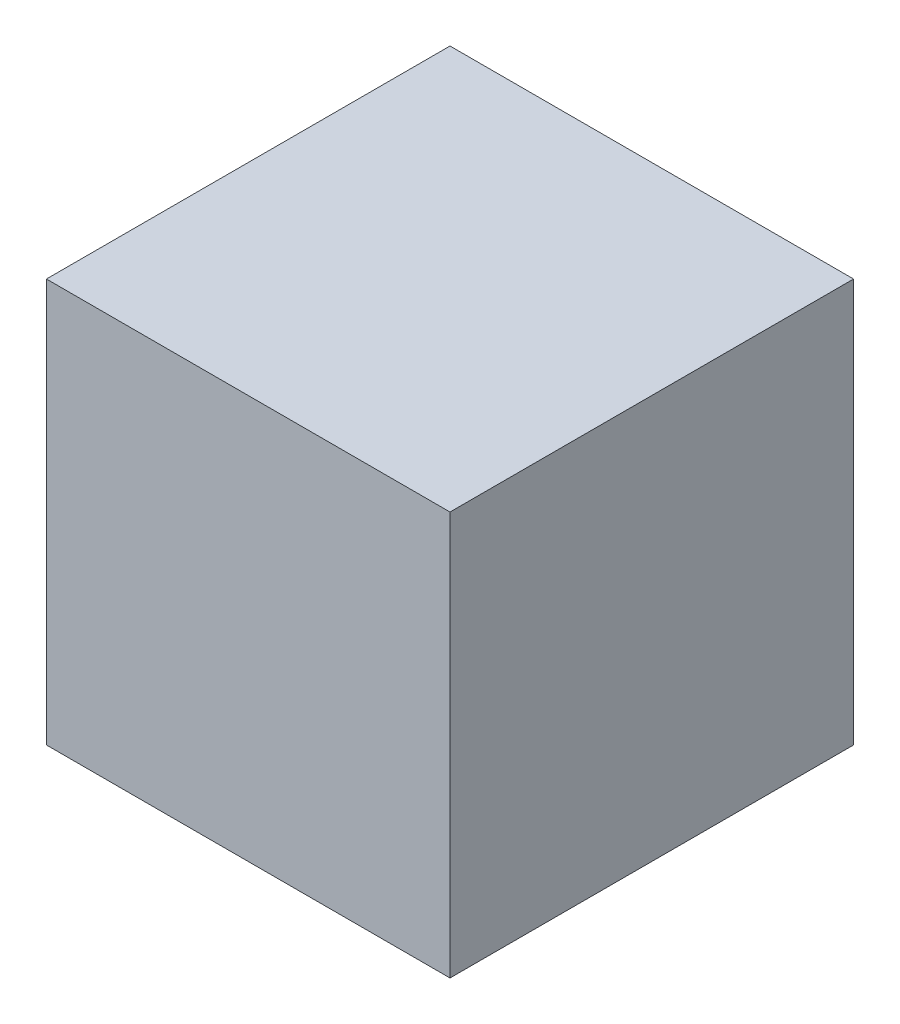
ISO-10303-21;
HEADER;
FILE_DESCRIPTION(('STEP AP214'),'2;1');
FILE_NAME('part.step','',(''),(''),'','','');
FILE_SCHEMA(('AUTOMOTIVE_DESIGN { 1 0 10303 214 1 1 1 1 }'));
ENDSEC;
DATA;
#1=APPLICATION_CONTEXT('core data for automotive mechanical design processes');
#2=APPLICATION_PROTOCOL_DEFINITION('international standard','automotive_design',2000,#1);
#3=PRODUCT_CONTEXT('',#1,'mechanical');
#4=PRODUCT('Part','Part','',(#3));
#5=PRODUCT_RELATED_PRODUCT_CATEGORY('part','',(#4));
#6=PRODUCT_DEFINITION_FORMATION('','',#4);
#7=PRODUCT_DEFINITION_CONTEXT('part definition',#1,'design');
#8=PRODUCT_DEFINITION('design','',#6,#7);
#9=PRODUCT_DEFINITION_SHAPE('','',#8);
#10=(LENGTH_UNIT() NAMED_UNIT(*) SI_UNIT(.MILLI.,.METRE.));
#11=(NAMED_UNIT(*) PLANE_ANGLE_UNIT() SI_UNIT($,.RADIAN.));
#12=(NAMED_UNIT(*) SI_UNIT($,.STERADIAN.) SOLID_ANGLE_UNIT());
#13=UNCERTAINTY_MEASURE_WITH_UNIT(LENGTH_MEASURE(1.E-05),#10,'distance_accuracy_value','');
#14=(GEOMETRIC_REPRESENTATION_CONTEXT(3) GLOBAL_UNCERTAINTY_ASSIGNED_CONTEXT((#13)) GLOBAL_UNIT_ASSIGNED_CONTEXT((#10,
#11,#12)) REPRESENTATION_CONTEXT('',''));
#15=CARTESIAN_POINT('',(0.,0.,0.));
#16=DIRECTION('',(0.,0.,1.));
#17=DIRECTION('',(1.,0.,0.));
#18=AXIS2_PLACEMENT_3D('',#15,#16,#17);
#19=CARTESIAN_POINT('',(0.,70.,0.));
#20=DIRECTION('',(1.,0.,0.));
#21=DIRECTION('',(0.,0.,-1.));
#22=AXIS2_PLACEMENT_3D('',#19,#20,#21);
#23=PLANE('',#22);
#24=DIRECTION('',(0.,0.,1.));
#25=VECTOR('',#24,1.);
#26=CARTESIAN_POINT('',(0.,0.,0.));
#27=LINE('',#26,#25);
#28=CARTESIAN_POINT('',(0.,0.,-70.));
#29=VERTEX_POINT('',#28);
#30=CARTESIAN_POINT('',(0.,0.,0.));
#31=VERTEX_POINT('',#30);
#32=EDGE_CURVE('E107',#29,#31,#27,.T.);
#33=ORIENTED_EDGE('',*,*,#32,.T.);
#34=DIRECTION('',(0.,-1.,0.));
#35=VECTOR('',#34,1.);
#36=CARTESIAN_POINT('',(0.,70.,0.));
#37=LINE('',#36,#35);
#38=CARTESIAN_POINT('',(0.,70.,0.));
#39=VERTEX_POINT('',#38);
#40=EDGE_CURVE('E11',#39,#31,#37,.T.);
#41=ORIENTED_EDGE('',*,*,#40,.F.);
#42=DIRECTION('',(0.,0.,1.));
#43=VECTOR('',#42,1.);
#44=CARTESIAN_POINT('',(0.,70.,0.));
#45=LINE('',#44,#43);
#46=CARTESIAN_POINT('',(0.,70.,-70.));
#47=VERTEX_POINT('',#46);
#48=EDGE_CURVE('E91',#47,#39,#45,.T.);
#49=ORIENTED_EDGE('',*,*,#48,.F.);
#50=DIRECTION('',(0.,-1.,0.));
#51=VECTOR('',#50,1.);
#52=CARTESIAN_POINT('',(0.,70.,-70.));
#53=LINE('',#52,#51);
#54=EDGE_CURVE('E103',#47,#29,#53,.T.);
#55=ORIENTED_EDGE('',*,*,#54,.T.);
#56=EDGE_LOOP('',(#33,#41,#49,#55));
#57=FACE_BOUND('',#56,.T.);
#58=ADVANCED_FACE('F39',(#57),#23,.F.);
#59=CARTESIAN_POINT('',(0.,70.,0.));
#60=DIRECTION('',(0.,0.,-1.));
#61=DIRECTION('',(-1.,0.,0.));
#62=AXIS2_PLACEMENT_3D('',#59,#60,#61);
#63=PLANE('',#62);
#64=DIRECTION('',(1.,0.,0.));
#65=VECTOR('',#64,1.);
#66=CARTESIAN_POINT('',(0.,0.,0.));
#67=LINE('',#66,#65);
#68=CARTESIAN_POINT('',(70.,0.,0.));
#69=VERTEX_POINT('',#68);
#70=EDGE_CURVE('E96',#31,#69,#67,.T.);
#71=ORIENTED_EDGE('',*,*,#70,.T.);
#72=DIRECTION('',(0.,-1.,0.));
#73=VECTOR('',#72,1.);
#74=CARTESIAN_POINT('',(70.,70.,0.));
#75=LINE('',#74,#73);
#76=CARTESIAN_POINT('',(70.,70.,0.));
#77=VERTEX_POINT('',#76);
#78=EDGE_CURVE('E48',#77,#69,#75,.T.);
#79=ORIENTED_EDGE('',*,*,#78,.F.);
#80=DIRECTION('',(1.,0.,0.));
#81=VECTOR('',#80,1.);
#82=CARTESIAN_POINT('',(0.,70.,0.));
#83=LINE('',#82,#81);
#84=EDGE_CURVE('E86',#39,#77,#83,.T.);
#85=ORIENTED_EDGE('',*,*,#84,.F.);
#86=ORIENTED_EDGE('',*,*,#40,.T.);
#87=EDGE_LOOP('',(#71,#79,#85,#86));
#88=FACE_BOUND('',#87,.T.);
#89=ADVANCED_FACE('F95',(#88),#63,.F.);
#90=CARTESIAN_POINT('',(70.,70.,0.));
#91=DIRECTION('',(-1.,0.,0.));
#92=DIRECTION('',(0.,0.,1.));
#93=AXIS2_PLACEMENT_3D('',#90,#91,#92);
#94=PLANE('',#93);
#95=DIRECTION('',(0.,0.,-1.));
#96=VECTOR('',#95,1.);
#97=CARTESIAN_POINT('',(70.,0.,0.));
#98=LINE('',#97,#96);
#99=CARTESIAN_POINT('',(70.,0.,-70.));
#100=VERTEX_POINT('',#99);
#101=EDGE_CURVE('E73',#69,#100,#98,.T.);
#102=ORIENTED_EDGE('',*,*,#101,.T.);
#103=DIRECTION('',(0.,-1.,0.));
#104=VECTOR('',#103,1.);
#105=CARTESIAN_POINT('',(70.,70.,-70.));
#106=LINE('',#105,#104);
#107=CARTESIAN_POINT('',(70.,70.,-70.));
#108=VERTEX_POINT('',#107);
#109=EDGE_CURVE('E98',#108,#100,#106,.T.);
#110=ORIENTED_EDGE('',*,*,#109,.F.);
#111=DIRECTION('',(0.,0.,-1.));
#112=VECTOR('',#111,1.);
#113=CARTESIAN_POINT('',(70.,70.,0.));
#114=LINE('',#113,#112);
#115=EDGE_CURVE('E89',#77,#108,#114,.T.);
#116=ORIENTED_EDGE('',*,*,#115,.F.);
#117=ORIENTED_EDGE('',*,*,#78,.T.);
#118=EDGE_LOOP('',(#102,#110,#116,#117));
#119=FACE_BOUND('',#118,.T.);
#120=ADVANCED_FACE('F99',(#119),#94,.F.);
#121=CARTESIAN_POINT('',(0.,70.,-70.));
#122=DIRECTION('',(0.,0.,1.));
#123=DIRECTION('',(1.,0.,0.));
#124=AXIS2_PLACEMENT_3D('',#121,#122,#123);
#125=PLANE('',#124);
#126=DIRECTION('',(-1.,0.,0.));
#127=VECTOR('',#126,1.);
#128=CARTESIAN_POINT('',(0.,0.,-70.));
#129=LINE('',#128,#127);
#130=EDGE_CURVE('E79',#100,#29,#129,.T.);
#131=ORIENTED_EDGE('',*,*,#130,.T.);
#132=ORIENTED_EDGE('',*,*,#54,.F.);
#133=DIRECTION('',(-1.,0.,0.));
#134=VECTOR('',#133,1.);
#135=CARTESIAN_POINT('',(0.,70.,-70.));
#136=LINE('',#135,#134);
#137=EDGE_CURVE('E56',#108,#47,#136,.T.);
#138=ORIENTED_EDGE('',*,*,#137,.F.);
#139=ORIENTED_EDGE('',*,*,#109,.T.);
#140=EDGE_LOOP('',(#131,#132,#138,#139));
#141=FACE_BOUND('',#140,.T.);
#142=ADVANCED_FACE('F120',(#141),#125,.F.);
#143=CARTESIAN_POINT('',(0.,70.,0.));
#144=DIRECTION('',(0.,-1.,0.));
#145=DIRECTION('',(0.,0.,-1.));
#146=AXIS2_PLACEMENT_3D('',#143,#144,#145);
#147=PLANE('',#146);
#148=ORIENTED_EDGE('',*,*,#48,.T.);
#149=ORIENTED_EDGE('',*,*,#84,.T.);
#150=ORIENTED_EDGE('',*,*,#115,.T.);
#151=ORIENTED_EDGE('',*,*,#137,.T.);
#152=EDGE_LOOP('',(#148,#149,#150,#151));
#153=FACE_BOUND('',#152,.T.);
#154=ADVANCED_FACE('F87',(#153),#147,.F.);
#155=CARTESIAN_POINT('',(0.,0.,0.));
#156=DIRECTION('',(0.,-1.,0.));
#157=DIRECTION('',(0.,0.,-1.));
#158=AXIS2_PLACEMENT_3D('',#155,#156,#157);
#159=PLANE('',#158);
#160=ORIENTED_EDGE('',*,*,#32,.F.);
#161=ORIENTED_EDGE('',*,*,#130,.F.);
#162=ORIENTED_EDGE('',*,*,#101,.F.);
#163=ORIENTED_EDGE('',*,*,#70,.F.);
#164=EDGE_LOOP('',(#160,#161,#162,#163));
#165=FACE_BOUND('',#164,.T.);
#166=ADVANCED_FACE('F123',(#165),#159,.T.);
#167=CLOSED_SHELL('',(#58,#89,#120,#142,#154,#166));
#168=MANIFOLD_SOLID_BREP('B2',#167);
#169=ADVANCED_BREP_SHAPE_REPRESENTATION('',(#18,#168),#14);
#170=SHAPE_DEFINITION_REPRESENTATION(#9,#169);
ENDSEC;
END-ISO-10303-21;
